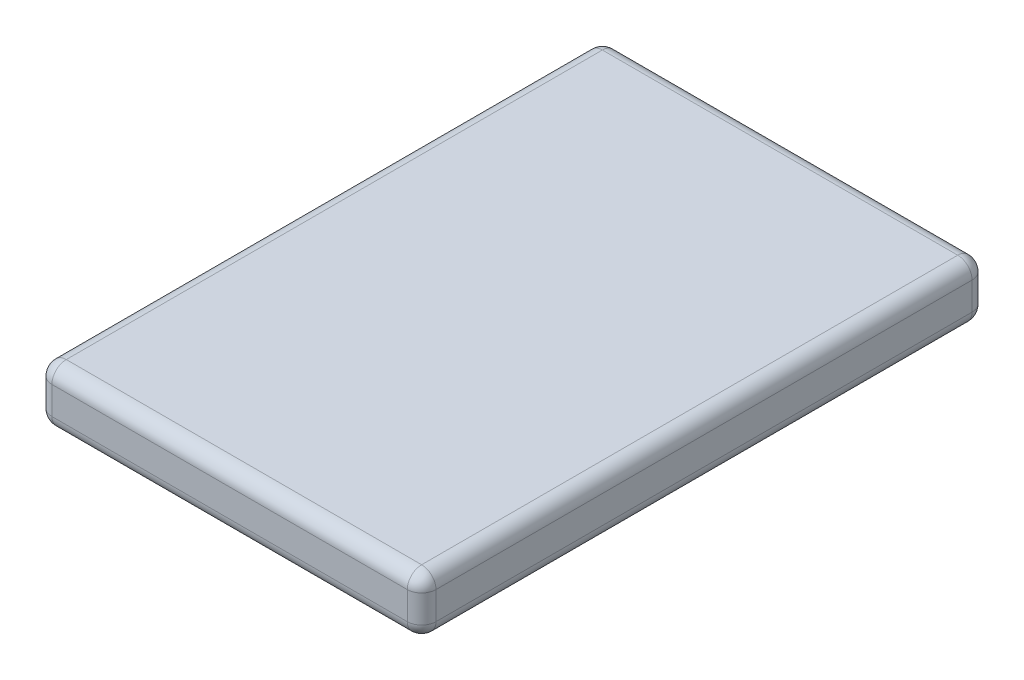
ISO-10303-21;
HEADER;
FILE_DESCRIPTION(('STEP AP214'),'2;1');
FILE_NAME('part.step','',(''),(''),'','','');
FILE_SCHEMA(('AUTOMOTIVE_DESIGN { 1 0 10303 214 1 1 1 1 }'));
ENDSEC;
DATA;
#1=APPLICATION_CONTEXT('core data for automotive mechanical design processes');
#2=APPLICATION_PROTOCOL_DEFINITION('international standard','automotive_design',2000,#1);
#3=PRODUCT_CONTEXT('',#1,'mechanical');
#4=PRODUCT('Part','Part','',(#3));
#5=PRODUCT_RELATED_PRODUCT_CATEGORY('part','',(#4));
#6=PRODUCT_DEFINITION_FORMATION('','',#4);
#7=PRODUCT_DEFINITION_CONTEXT('part definition',#1,'design');
#8=PRODUCT_DEFINITION('design','',#6,#7);
#9=PRODUCT_DEFINITION_SHAPE('','',#8);
#10=(LENGTH_UNIT() NAMED_UNIT(*) SI_UNIT(.MILLI.,.METRE.));
#11=(NAMED_UNIT(*) PLANE_ANGLE_UNIT() SI_UNIT($,.RADIAN.));
#12=(NAMED_UNIT(*) SI_UNIT($,.STERADIAN.) SOLID_ANGLE_UNIT());
#13=UNCERTAINTY_MEASURE_WITH_UNIT(LENGTH_MEASURE(1.E-05),#10,'distance_accuracy_value','');
#14=(GEOMETRIC_REPRESENTATION_CONTEXT(3) GLOBAL_UNCERTAINTY_ASSIGNED_CONTEXT((#13)) GLOBAL_UNIT_ASSIGNED_CONTEXT((#10,
#11,#12)) REPRESENTATION_CONTEXT('',''));
#15=CARTESIAN_POINT('',(0.,0.,0.));
#16=DIRECTION('',(0.,0.,1.));
#17=DIRECTION('',(1.,0.,0.));
#18=AXIS2_PLACEMENT_3D('',#15,#16,#17);
#19=CARTESIAN_POINT('',(-15.73,-1.23,50.000000076));
#20=DIRECTION('',(0.,0.,-1.));
#21=DIRECTION('',(-1.,0.,0.));
#22=AXIS2_PLACEMENT_3D('',#19,#20,#21);
#23=CYLINDRICAL_SURFACE('',#22,1.27);
#24=DIRECTION('',(0.,0.,-1.));
#25=VECTOR('',#24,1.);
#26=CARTESIAN_POINT('',(-15.73,-2.5,50.000000076));
#27=LINE('',#26,#25);
#28=CARTESIAN_POINT('',(-15.73,-2.5,48.730000076));
#29=VERTEX_POINT('',#28);
#30=CARTESIAN_POINT('',(-15.73,-2.5,1.27));
#31=VERTEX_POINT('',#30);
#32=EDGE_CURVE('E170',#29,#31,#27,.T.);
#33=ORIENTED_EDGE('',*,*,#32,.F.);
#34=CARTESIAN_POINT('',(-15.73,-1.23,48.730000076));
#35=DIRECTION('',(0.,0.,-1.));
#36=DIRECTION('',(-1.,0.,0.));
#37=AXIS2_PLACEMENT_3D('',#34,#35,#36);
#38=CIRCLE('',#37,1.27);
#39=CARTESIAN_POINT('',(-17.,-1.23,48.730000076));
#40=VERTEX_POINT('',#39);
#41=EDGE_CURVE('E190',#29,#40,#38,.T.);
#42=ORIENTED_EDGE('',*,*,#41,.T.);
#43=DIRECTION('',(0.,0.,-1.));
#44=VECTOR('',#43,1.);
#45=CARTESIAN_POINT('',(-17.,-1.23,50.000000076));
#46=LINE('',#45,#44);
#47=CARTESIAN_POINT('',(-17.,-1.23,1.27));
#48=VERTEX_POINT('',#47);
#49=EDGE_CURVE('E256',#40,#48,#46,.T.);
#50=ORIENTED_EDGE('',*,*,#49,.T.);
#51=CARTESIAN_POINT('',(-15.73,-1.23,1.27));
#52=DIRECTION('',(0.,0.,-1.));
#53=DIRECTION('',(-1.,0.,0.));
#54=AXIS2_PLACEMENT_3D('',#51,#52,#53);
#55=CIRCLE('',#54,1.27);
#56=EDGE_CURVE('E187',#48,#31,#55,.F.);
#57=ORIENTED_EDGE('',*,*,#56,.T.);
#58=EDGE_LOOP('',(#33,#42,#50,#57));
#59=FACE_BOUND('',#58,.T.);
#60=ADVANCED_FACE('F45',(#59),#23,.T.);
#61=CARTESIAN_POINT('',(-15.73,-2.5,50.000000076));
#62=DIRECTION('',(0.,1.,0.));
#63=DIRECTION('',(0.,0.,1.));
#64=AXIS2_PLACEMENT_3D('',#61,#62,#63);
#65=PLANE('',#64);
#66=DIRECTION('',(0.,0.,-1.));
#67=VECTOR('',#66,1.);
#68=CARTESIAN_POINT('',(15.73,-2.5,50.000000076));
#69=LINE('',#68,#67);
#70=CARTESIAN_POINT('',(15.73,-2.5,48.730000076));
#71=VERTEX_POINT('',#70);
#72=CARTESIAN_POINT('',(15.73,-2.5,1.27));
#73=VERTEX_POINT('',#72);
#74=EDGE_CURVE('E315',#71,#73,#69,.T.);
#75=ORIENTED_EDGE('',*,*,#74,.F.);
#76=DIRECTION('',(1.,0.,0.));
#77=VECTOR('',#76,1.);
#78=CARTESIAN_POINT('',(-15.73,-2.5,48.730000076));
#79=LINE('',#78,#77);
#80=EDGE_CURVE('E145',#71,#29,#79,.F.);
#81=ORIENTED_EDGE('',*,*,#80,.T.);
#82=ORIENTED_EDGE('',*,*,#32,.T.);
#83=DIRECTION('',(1.,0.,0.));
#84=VECTOR('',#83,1.);
#85=CARTESIAN_POINT('',(15.73,-2.5,1.27));
#86=LINE('',#85,#84);
#87=EDGE_CURVE('E177',#31,#73,#86,.T.);
#88=ORIENTED_EDGE('',*,*,#87,.T.);
#89=EDGE_LOOP('',(#75,#81,#82,#88));
#90=FACE_BOUND('',#89,.T.);
#91=ADVANCED_FACE('F351',(#90),#65,.F.);
#92=CARTESIAN_POINT('',(15.73,-1.23,50.000000076));
#93=DIRECTION('',(0.,0.,-1.));
#94=DIRECTION('',(-1.,0.,0.));
#95=AXIS2_PLACEMENT_3D('',#92,#93,#94);
#96=CYLINDRICAL_SURFACE('',#95,1.27);
#97=ORIENTED_EDGE('',*,*,#74,.T.);
#98=CARTESIAN_POINT('',(15.73,-1.23,1.27));
#99=DIRECTION('',(0.,0.,-1.));
#100=DIRECTION('',(-1.,0.,0.));
#101=AXIS2_PLACEMENT_3D('',#98,#99,#100);
#102=CIRCLE('',#101,1.27);
#103=CARTESIAN_POINT('',(17.,-1.23,1.27));
#104=VERTEX_POINT('',#103);
#105=EDGE_CURVE('E225',#73,#104,#102,.F.);
#106=ORIENTED_EDGE('',*,*,#105,.T.);
#107=DIRECTION('',(0.,0.,-1.));
#108=VECTOR('',#107,1.);
#109=CARTESIAN_POINT('',(17.,-1.23,50.000000076));
#110=LINE('',#109,#108);
#111=CARTESIAN_POINT('',(17.,-1.23,48.730000076));
#112=VERTEX_POINT('',#111);
#113=EDGE_CURVE('E313',#112,#104,#110,.T.);
#114=ORIENTED_EDGE('',*,*,#113,.F.);
#115=CARTESIAN_POINT('',(15.73,-1.23,48.730000076));
#116=DIRECTION('',(0.,0.,-1.));
#117=DIRECTION('',(-1.,0.,0.));
#118=AXIS2_PLACEMENT_3D('',#115,#116,#117);
#119=CIRCLE('',#118,1.27);
#120=EDGE_CURVE('E155',#112,#71,#119,.T.);
#121=ORIENTED_EDGE('',*,*,#120,.T.);
#122=EDGE_LOOP('',(#97,#106,#114,#121));
#123=FACE_BOUND('',#122,.T.);
#124=ADVANCED_FACE('F312',(#123),#96,.T.);
#125=CARTESIAN_POINT('',(17.,-1.23,50.000000076));
#126=DIRECTION('',(-1.,0.,0.));
#127=DIRECTION('',(0.,0.,1.));
#128=AXIS2_PLACEMENT_3D('',#125,#126,#127);
#129=PLANE('',#128);
#130=DIRECTION('',(0.,0.,-1.));
#131=VECTOR('',#130,1.);
#132=CARTESIAN_POINT('',(17.,1.23,50.000000076));
#133=LINE('',#132,#131);
#134=CARTESIAN_POINT('',(17.,1.23,48.730000076));
#135=VERTEX_POINT('',#134);
#136=CARTESIAN_POINT('',(17.,1.23,1.27));
#137=VERTEX_POINT('',#136);
#138=EDGE_CURVE('E318',#135,#137,#133,.T.);
#139=ORIENTED_EDGE('',*,*,#138,.F.);
#140=DIRECTION('',(0.,1.,0.));
#141=VECTOR('',#140,1.);
#142=CARTESIAN_POINT('',(17.,-1.23,48.730000076));
#143=LINE('',#142,#141);
#144=EDGE_CURVE('E220',#135,#112,#143,.F.);
#145=ORIENTED_EDGE('',*,*,#144,.T.);
#146=ORIENTED_EDGE('',*,*,#113,.T.);
#147=DIRECTION('',(0.,1.,0.));
#148=VECTOR('',#147,1.);
#149=CARTESIAN_POINT('',(17.,1.23,1.27));
#150=LINE('',#149,#148);
#151=EDGE_CURVE('E217',#104,#137,#150,.T.);
#152=ORIENTED_EDGE('',*,*,#151,.T.);
#153=EDGE_LOOP('',(#139,#145,#146,#152));
#154=FACE_BOUND('',#153,.T.);
#155=ADVANCED_FACE('F316',(#154),#129,.F.);
#156=CARTESIAN_POINT('',(15.73,1.23,50.000000076));
#157=DIRECTION('',(0.,0.,-1.));
#158=DIRECTION('',(-1.,0.,0.));
#159=AXIS2_PLACEMENT_3D('',#156,#157,#158);
#160=CYLINDRICAL_SURFACE('',#159,1.27);
#161=DIRECTION('',(0.,0.,-1.));
#162=VECTOR('',#161,1.);
#163=CARTESIAN_POINT('',(15.73,2.5,50.000000076));
#164=LINE('',#163,#162);
#165=CARTESIAN_POINT('',(15.73,2.5,48.730000076));
#166=VERTEX_POINT('',#165);
#167=CARTESIAN_POINT('',(15.73,2.5,1.27));
#168=VERTEX_POINT('',#167);
#169=EDGE_CURVE('E323',#166,#168,#164,.T.);
#170=ORIENTED_EDGE('',*,*,#169,.F.);
#171=CARTESIAN_POINT('',(15.73,1.23,48.730000076));
#172=DIRECTION('',(0.,0.,-1.));
#173=DIRECTION('',(-1.,0.,0.));
#174=AXIS2_PLACEMENT_3D('',#171,#172,#173);
#175=CIRCLE('',#174,1.27);
#176=EDGE_CURVE('E214',#166,#135,#175,.T.);
#177=ORIENTED_EDGE('',*,*,#176,.T.);
#178=ORIENTED_EDGE('',*,*,#138,.T.);
#179=CARTESIAN_POINT('',(15.73,1.23,1.27));
#180=DIRECTION('',(0.,0.,-1.));
#181=DIRECTION('',(-1.,0.,0.));
#182=AXIS2_PLACEMENT_3D('',#179,#180,#181);
#183=CIRCLE('',#182,1.27);
#184=EDGE_CURVE('E211',#137,#168,#183,.F.);
#185=ORIENTED_EDGE('',*,*,#184,.T.);
#186=EDGE_LOOP('',(#170,#177,#178,#185));
#187=FACE_BOUND('',#186,.T.);
#188=ADVANCED_FACE('F519',(#187),#160,.T.);
#189=CARTESIAN_POINT('',(-15.73,2.5,50.000000076));
#190=DIRECTION('',(0.,-1.,0.));
#191=DIRECTION('',(0.,0.,-1.));
#192=AXIS2_PLACEMENT_3D('',#189,#190,#191);
#193=PLANE('',#192);
#194=DIRECTION('',(0.,0.,-1.));
#195=VECTOR('',#194,1.);
#196=CARTESIAN_POINT('',(-15.73,2.5,50.000000076));
#197=LINE('',#196,#195);
#198=CARTESIAN_POINT('',(-15.73,2.5,48.730000076));
#199=VERTEX_POINT('',#198);
#200=CARTESIAN_POINT('',(-15.73,2.5,1.27));
#201=VERTEX_POINT('',#200);
#202=EDGE_CURVE('E578',#199,#201,#197,.T.);
#203=ORIENTED_EDGE('',*,*,#202,.F.);
#204=DIRECTION('',(-1.,0.,0.));
#205=VECTOR('',#204,1.);
#206=CARTESIAN_POINT('',(-15.73,2.5,48.730000076));
#207=LINE('',#206,#205);
#208=EDGE_CURVE('E208',#199,#166,#207,.F.);
#209=ORIENTED_EDGE('',*,*,#208,.T.);
#210=ORIENTED_EDGE('',*,*,#169,.T.);
#211=DIRECTION('',(-1.,0.,0.));
#212=VECTOR('',#211,1.);
#213=CARTESIAN_POINT('',(-15.73,2.5,1.27));
#214=LINE('',#213,#212);
#215=EDGE_CURVE('E205',#168,#201,#214,.T.);
#216=ORIENTED_EDGE('',*,*,#215,.T.);
#217=EDGE_LOOP('',(#203,#209,#210,#216));
#218=FACE_BOUND('',#217,.T.);
#219=ADVANCED_FACE('F510',(#218),#193,.F.);
#220=CARTESIAN_POINT('',(-15.73,1.23,50.000000076));
#221=DIRECTION('',(0.,0.,-1.));
#222=DIRECTION('',(-1.,0.,0.));
#223=AXIS2_PLACEMENT_3D('',#220,#221,#222);
#224=CYLINDRICAL_SURFACE('',#223,1.27);
#225=DIRECTION('',(0.,0.,-1.));
#226=VECTOR('',#225,1.);
#227=CARTESIAN_POINT('',(-17.,1.23,50.000000076));
#228=LINE('',#227,#226);
#229=CARTESIAN_POINT('',(-17.,1.23,48.730000076));
#230=VERTEX_POINT('',#229);
#231=CARTESIAN_POINT('',(-17.,1.23,1.27));
#232=VERTEX_POINT('',#231);
#233=EDGE_CURVE('E581',#230,#232,#228,.T.);
#234=ORIENTED_EDGE('',*,*,#233,.F.);
#235=CARTESIAN_POINT('',(-15.73,1.23,48.730000076));
#236=DIRECTION('',(0.,0.,-1.));
#237=DIRECTION('',(-1.,0.,0.));
#238=AXIS2_PLACEMENT_3D('',#235,#236,#237);
#239=CIRCLE('',#238,1.27);
#240=EDGE_CURVE('E202',#230,#199,#239,.T.);
#241=ORIENTED_EDGE('',*,*,#240,.T.);
#242=ORIENTED_EDGE('',*,*,#202,.T.);
#243=CARTESIAN_POINT('',(-15.73,1.23,1.27));
#244=DIRECTION('',(0.,0.,-1.));
#245=DIRECTION('',(-1.,0.,0.));
#246=AXIS2_PLACEMENT_3D('',#243,#244,#245);
#247=CIRCLE('',#246,1.27);
#248=EDGE_CURVE('E199',#201,#232,#247,.F.);
#249=ORIENTED_EDGE('',*,*,#248,.T.);
#250=EDGE_LOOP('',(#234,#241,#242,#249));
#251=FACE_BOUND('',#250,.T.);
#252=ADVANCED_FACE('F501',(#251),#224,.T.);
#253=CARTESIAN_POINT('',(-17.,-1.23,50.000000076));
#254=DIRECTION('',(1.,0.,0.));
#255=DIRECTION('',(0.,0.,-1.));
#256=AXIS2_PLACEMENT_3D('',#253,#254,#255);
#257=PLANE('',#256);
#258=ORIENTED_EDGE('',*,*,#49,.F.);
#259=DIRECTION('',(0.,-1.,0.));
#260=VECTOR('',#259,1.);
#261=CARTESIAN_POINT('',(-17.,-1.23,48.730000076));
#262=LINE('',#261,#260);
#263=EDGE_CURVE('E196',#40,#230,#262,.F.);
#264=ORIENTED_EDGE('',*,*,#263,.T.);
#265=ORIENTED_EDGE('',*,*,#233,.T.);
#266=DIRECTION('',(0.,-1.,0.));
#267=VECTOR('',#266,1.);
#268=CARTESIAN_POINT('',(-17.,-1.23,1.27));
#269=LINE('',#268,#267);
#270=EDGE_CURVE('E193',#232,#48,#269,.T.);
#271=ORIENTED_EDGE('',*,*,#270,.T.);
#272=EDGE_LOOP('',(#258,#264,#265,#271));
#273=FACE_BOUND('',#272,.T.);
#274=ADVANCED_FACE('F493',(#273),#257,.F.);
#275=CARTESIAN_POINT('',(-15.73,-1.23,50.000000076));
#276=DIRECTION('',(0.,0.,-1.));
#277=DIRECTION('',(-1.,0.,0.));
#278=AXIS2_PLACEMENT_3D('',#275,#276,#277);
#279=PLANE('',#278);
#280=DIRECTION('',(0.,-1.,0.));
#281=VECTOR('',#280,1.);
#282=CARTESIAN_POINT('',(-15.73,-1.23,50.000000076));
#283=LINE('',#282,#281);
#284=CARTESIAN_POINT('',(-15.73,1.23,50.000000076));
#285=VERTEX_POINT('',#284);
#286=CARTESIAN_POINT('',(-15.73,-1.23,50.000000076));
#287=VERTEX_POINT('',#286);
#288=EDGE_CURVE('E174',#285,#287,#283,.T.);
#289=ORIENTED_EDGE('',*,*,#288,.T.);
#290=DIRECTION('',(1.,0.,0.));
#291=VECTOR('',#290,1.);
#292=CARTESIAN_POINT('',(-15.73,-1.23,50.000000076));
#293=LINE('',#292,#291);
#294=CARTESIAN_POINT('',(15.73,-1.23,50.000000076));
#295=VERTEX_POINT('',#294);
#296=EDGE_CURVE('E143',#287,#295,#293,.T.);
#297=ORIENTED_EDGE('',*,*,#296,.T.);
#298=DIRECTION('',(0.,1.,0.));
#299=VECTOR('',#298,1.);
#300=CARTESIAN_POINT('',(15.73,-1.23,50.000000076));
#301=LINE('',#300,#299);
#302=CARTESIAN_POINT('',(15.73,1.23,50.000000076));
#303=VERTEX_POINT('',#302);
#304=EDGE_CURVE('E162',#295,#303,#301,.T.);
#305=ORIENTED_EDGE('',*,*,#304,.T.);
#306=DIRECTION('',(-1.,0.,0.));
#307=VECTOR('',#306,1.);
#308=CARTESIAN_POINT('',(-15.73,1.23,50.000000076));
#309=LINE('',#308,#307);
#310=EDGE_CURVE('E169',#303,#285,#309,.T.);
#311=ORIENTED_EDGE('',*,*,#310,.T.);
#312=EDGE_LOOP('',(#289,#297,#305,#311));
#313=FACE_BOUND('',#312,.T.);
#314=ADVANCED_FACE('F172',(#313),#279,.F.);
#315=CARTESIAN_POINT('',(-15.73,-1.23,0.));
#316=DIRECTION('',(0.,0.,-1.));
#317=DIRECTION('',(-1.,0.,0.));
#318=AXIS2_PLACEMENT_3D('',#315,#316,#317);
#319=PLANE('',#318);
#320=DIRECTION('',(0.,1.,0.));
#321=VECTOR('',#320,1.);
#322=CARTESIAN_POINT('',(15.73,-1.23,0.));
#323=LINE('',#322,#321);
#324=CARTESIAN_POINT('',(15.73,1.23,0.));
#325=VERTEX_POINT('',#324);
#326=CARTESIAN_POINT('',(15.73,-1.23,0.));
#327=VERTEX_POINT('',#326);
#328=EDGE_CURVE('E229',#325,#327,#323,.F.);
#329=ORIENTED_EDGE('',*,*,#328,.T.);
#330=DIRECTION('',(1.,0.,0.));
#331=VECTOR('',#330,1.);
#332=CARTESIAN_POINT('',(-15.73,-1.23,0.));
#333=LINE('',#332,#331);
#334=CARTESIAN_POINT('',(-15.73,-1.23,0.));
#335=VERTEX_POINT('',#334);
#336=EDGE_CURVE('E11',#327,#335,#333,.F.);
#337=ORIENTED_EDGE('',*,*,#336,.T.);
#338=DIRECTION('',(0.,-1.,0.));
#339=VECTOR('',#338,1.);
#340=CARTESIAN_POINT('',(-15.73,1.23,0.));
#341=LINE('',#340,#339);
#342=CARTESIAN_POINT('',(-15.73,1.23,0.));
#343=VERTEX_POINT('',#342);
#344=EDGE_CURVE('E55',#335,#343,#341,.F.);
#345=ORIENTED_EDGE('',*,*,#344,.T.);
#346=DIRECTION('',(-1.,0.,0.));
#347=VECTOR('',#346,1.);
#348=CARTESIAN_POINT('',(15.73,1.23,0.));
#349=LINE('',#348,#347);
#350=EDGE_CURVE('E232',#343,#325,#349,.F.);
#351=ORIENTED_EDGE('',*,*,#350,.T.);
#352=EDGE_LOOP('',(#329,#337,#345,#351));
#353=FACE_BOUND('',#352,.T.);
#354=ADVANCED_FACE('F294',(#353),#319,.T.);
#355=CARTESIAN_POINT('',(-15.73,1.23,48.730000076));
#356=DIRECTION('',(-1.,0.,0.));
#357=DIRECTION('',(0.,0.,1.));
#358=AXIS2_PLACEMENT_3D('',#355,#356,#357);
#359=CYLINDRICAL_SURFACE('',#358,1.27);
#360=CARTESIAN_POINT('',(15.73,1.23,48.730000076));
#361=DIRECTION('',(1.,0.,0.));
#362=DIRECTION('',(0.,0.,-1.));
#363=AXIS2_PLACEMENT_3D('',#360,#361,#362);
#364=CIRCLE('',#363,1.27);
#365=EDGE_CURVE('E248',#166,#303,#364,.T.);
#366=ORIENTED_EDGE('',*,*,#365,.F.);
#367=ORIENTED_EDGE('',*,*,#208,.F.);
#368=CARTESIAN_POINT('',(-15.73,1.23,48.730000076));
#369=DIRECTION('',(-1.,0.,0.));
#370=DIRECTION('',(0.,0.,1.));
#371=AXIS2_PLACEMENT_3D('',#368,#369,#370);
#372=CIRCLE('',#371,1.27);
#373=EDGE_CURVE('E252',#285,#199,#372,.T.);
#374=ORIENTED_EDGE('',*,*,#373,.F.);
#375=ORIENTED_EDGE('',*,*,#310,.F.);
#376=EDGE_LOOP('',(#366,#367,#374,#375));
#377=FACE_BOUND('',#376,.T.);
#378=ADVANCED_FACE('F335',(#377),#359,.T.);
#379=CARTESIAN_POINT('',(-15.73,1.23,48.730000076));
#380=DIRECTION('',(0.,0.,-1.));
#381=DIRECTION('',(-1.,0.,0.));
#382=AXIS2_PLACEMENT_3D('',#379,#380,#381);
#383=SPHERICAL_SURFACE('',#382,1.27);
#384=ORIENTED_EDGE('',*,*,#373,.T.);
#385=ORIENTED_EDGE('',*,*,#240,.F.);
#386=CARTESIAN_POINT('',(-15.73,1.23,48.730000076));
#387=DIRECTION('',(0.,-1.,0.));
#388=DIRECTION('',(1.,0.,0.));
#389=AXIS2_PLACEMENT_3D('',#386,#387,#388);
#390=CIRCLE('',#389,1.27);
#391=EDGE_CURVE('E244',#285,#230,#390,.T.);
#392=ORIENTED_EDGE('',*,*,#391,.F.);
#393=EDGE_LOOP('',(#384,#385,#392));
#394=FACE_BOUND('',#393,.T.);
#395=ADVANCED_FACE('F338',(#394),#383,.T.);
#396=CARTESIAN_POINT('',(15.73,1.23,48.730000076));
#397=DIRECTION('',(0.,0.,-1.));
#398=DIRECTION('',(-1.,0.,0.));
#399=AXIS2_PLACEMENT_3D('',#396,#397,#398);
#400=SPHERICAL_SURFACE('',#399,1.27);
#401=ORIENTED_EDGE('',*,*,#176,.F.);
#402=ORIENTED_EDGE('',*,*,#365,.T.);
#403=CARTESIAN_POINT('',(15.73,1.23,48.730000076));
#404=DIRECTION('',(0.,-1.,0.));
#405=DIRECTION('',(1.,0.,0.));
#406=AXIS2_PLACEMENT_3D('',#403,#404,#405);
#407=CIRCLE('',#406,1.27);
#408=EDGE_CURVE('E165',#135,#303,#407,.T.);
#409=ORIENTED_EDGE('',*,*,#408,.F.);
#410=EDGE_LOOP('',(#401,#402,#409));
#411=FACE_BOUND('',#410,.T.);
#412=ADVANCED_FACE('F383',(#411),#400,.T.);
#413=CARTESIAN_POINT('',(-15.73,-1.23,48.730000076));
#414=DIRECTION('',(0.,-1.,0.));
#415=DIRECTION('',(0.,0.,-1.));
#416=AXIS2_PLACEMENT_3D('',#413,#414,#415);
#417=CYLINDRICAL_SURFACE('',#416,1.27);
#418=ORIENTED_EDGE('',*,*,#391,.T.);
#419=ORIENTED_EDGE('',*,*,#263,.F.);
#420=CARTESIAN_POINT('',(-15.73,-1.23,48.730000076));
#421=DIRECTION('',(0.,-1.,0.));
#422=DIRECTION('',(1.,0.,0.));
#423=AXIS2_PLACEMENT_3D('',#420,#421,#422);
#424=CIRCLE('',#423,1.27);
#425=EDGE_CURVE('E159',#287,#40,#424,.T.);
#426=ORIENTED_EDGE('',*,*,#425,.F.);
#427=ORIENTED_EDGE('',*,*,#288,.F.);
#428=EDGE_LOOP('',(#418,#419,#426,#427));
#429=FACE_BOUND('',#428,.T.);
#430=ADVANCED_FACE('F341',(#429),#417,.T.);
#431=CARTESIAN_POINT('',(15.73,-1.23,48.730000076));
#432=DIRECTION('',(0.,1.,0.));
#433=DIRECTION('',(0.,0.,1.));
#434=AXIS2_PLACEMENT_3D('',#431,#432,#433);
#435=CYLINDRICAL_SURFACE('',#434,1.27);
#436=ORIENTED_EDGE('',*,*,#408,.T.);
#437=ORIENTED_EDGE('',*,*,#304,.F.);
#438=CARTESIAN_POINT('',(15.73,-1.23,48.730000076));
#439=DIRECTION('',(0.,-1.,0.));
#440=DIRECTION('',(0.,0.,-1.));
#441=AXIS2_PLACEMENT_3D('',#438,#439,#440);
#442=CIRCLE('',#441,1.27);
#443=EDGE_CURVE('E152',#112,#295,#442,.T.);
#444=ORIENTED_EDGE('',*,*,#443,.F.);
#445=ORIENTED_EDGE('',*,*,#144,.F.);
#446=EDGE_LOOP('',(#436,#437,#444,#445));
#447=FACE_BOUND('',#446,.T.);
#448=ADVANCED_FACE('F163',(#447),#435,.T.);
#449=CARTESIAN_POINT('',(-15.73,-1.23,48.730000076));
#450=DIRECTION('',(0.,0.,-1.));
#451=DIRECTION('',(-1.,0.,0.));
#452=AXIS2_PLACEMENT_3D('',#449,#450,#451);
#453=SPHERICAL_SURFACE('',#452,1.27);
#454=ORIENTED_EDGE('',*,*,#425,.T.);
#455=ORIENTED_EDGE('',*,*,#41,.F.);
#456=CARTESIAN_POINT('',(-15.73,-1.23,48.730000076));
#457=DIRECTION('',(1.,0.,0.));
#458=DIRECTION('',(0.,0.,-1.));
#459=AXIS2_PLACEMENT_3D('',#456,#457,#458);
#460=CIRCLE('',#459,1.27);
#461=EDGE_CURVE('E149',#287,#29,#460,.T.);
#462=ORIENTED_EDGE('',*,*,#461,.F.);
#463=EDGE_LOOP('',(#454,#455,#462));
#464=FACE_BOUND('',#463,.T.);
#465=ADVANCED_FACE('F345',(#464),#453,.T.);
#466=CARTESIAN_POINT('',(15.73,-1.23,48.730000076));
#467=DIRECTION('',(0.,0.,-1.));
#468=DIRECTION('',(-1.,0.,0.));
#469=AXIS2_PLACEMENT_3D('',#466,#467,#468);
#470=SPHERICAL_SURFACE('',#469,1.27);
#471=ORIENTED_EDGE('',*,*,#120,.F.);
#472=ORIENTED_EDGE('',*,*,#443,.T.);
#473=CARTESIAN_POINT('',(15.73,-1.23,48.730000076));
#474=DIRECTION('',(-1.,0.,0.));
#475=DIRECTION('',(0.,0.,1.));
#476=AXIS2_PLACEMENT_3D('',#473,#474,#475);
#477=CIRCLE('',#476,1.27);
#478=EDGE_CURVE('E139',#71,#295,#477,.T.);
#479=ORIENTED_EDGE('',*,*,#478,.F.);
#480=EDGE_LOOP('',(#471,#472,#479));
#481=FACE_BOUND('',#480,.T.);
#482=ADVANCED_FACE('F154',(#481),#470,.T.);
#483=CARTESIAN_POINT('',(-15.73,-1.23,48.730000076));
#484=DIRECTION('',(1.,0.,0.));
#485=DIRECTION('',(0.,0.,-1.));
#486=AXIS2_PLACEMENT_3D('',#483,#484,#485);
#487=CYLINDRICAL_SURFACE('',#486,1.27);
#488=ORIENTED_EDGE('',*,*,#461,.T.);
#489=ORIENTED_EDGE('',*,*,#80,.F.);
#490=ORIENTED_EDGE('',*,*,#478,.T.);
#491=ORIENTED_EDGE('',*,*,#296,.F.);
#492=EDGE_LOOP('',(#488,#489,#490,#491));
#493=FACE_BOUND('',#492,.T.);
#494=ADVANCED_FACE('F141',(#493),#487,.T.);
#495=CARTESIAN_POINT('',(-15.73,1.23,1.27));
#496=DIRECTION('',(0.,0.,-1.));
#497=DIRECTION('',(-1.,0.,0.));
#498=AXIS2_PLACEMENT_3D('',#495,#496,#497);
#499=SPHERICAL_SURFACE('',#498,1.27);
#500=CARTESIAN_POINT('',(-15.73,1.23,1.27));
#501=DIRECTION('',(1.,0.,0.));
#502=DIRECTION('',(0.,0.,-1.));
#503=AXIS2_PLACEMENT_3D('',#500,#501,#502);
#504=CIRCLE('',#503,1.27);
#505=EDGE_CURVE('E276',#343,#201,#504,.T.);
#506=ORIENTED_EDGE('',*,*,#505,.F.);
#507=CARTESIAN_POINT('',(-15.73,1.23,1.27));
#508=DIRECTION('',(0.,-1.,0.));
#509=DIRECTION('',(1.,0.,0.));
#510=AXIS2_PLACEMENT_3D('',#507,#508,#509);
#511=CIRCLE('',#510,1.27);
#512=EDGE_CURVE('E49',#232,#343,#511,.T.);
#513=ORIENTED_EDGE('',*,*,#512,.F.);
#514=ORIENTED_EDGE('',*,*,#248,.F.);
#515=EDGE_LOOP('',(#506,#513,#514));
#516=FACE_BOUND('',#515,.T.);
#517=ADVANCED_FACE('F47',(#516),#499,.T.);
#518=CARTESIAN_POINT('',(-15.73,-1.23,1.27));
#519=DIRECTION('',(0.,1.,0.));
#520=DIRECTION('',(0.,0.,1.));
#521=AXIS2_PLACEMENT_3D('',#518,#519,#520);
#522=CYLINDRICAL_SURFACE('',#521,1.27);
#523=ORIENTED_EDGE('',*,*,#512,.T.);
#524=ORIENTED_EDGE('',*,*,#344,.F.);
#525=CARTESIAN_POINT('',(-15.73,-1.23,1.27));
#526=DIRECTION('',(0.,-1.,0.));
#527=DIRECTION('',(0.,0.,-1.));
#528=AXIS2_PLACEMENT_3D('',#525,#526,#527);
#529=CIRCLE('',#528,1.27);
#530=EDGE_CURVE('E274',#48,#335,#529,.T.);
#531=ORIENTED_EDGE('',*,*,#530,.F.);
#532=ORIENTED_EDGE('',*,*,#270,.F.);
#533=EDGE_LOOP('',(#523,#524,#531,#532));
#534=FACE_BOUND('',#533,.T.);
#535=ADVANCED_FACE('F287',(#534),#522,.T.);
#536=CARTESIAN_POINT('',(-15.73,1.23,1.27));
#537=DIRECTION('',(1.,0.,0.));
#538=DIRECTION('',(0.,0.,-1.));
#539=AXIS2_PLACEMENT_3D('',#536,#537,#538);
#540=CYLINDRICAL_SURFACE('',#539,1.27);
#541=ORIENTED_EDGE('',*,*,#505,.T.);
#542=ORIENTED_EDGE('',*,*,#215,.F.);
#543=CARTESIAN_POINT('',(15.73,1.23,1.27));
#544=DIRECTION('',(1.,0.,0.));
#545=DIRECTION('',(0.,0.,-1.));
#546=AXIS2_PLACEMENT_3D('',#543,#544,#545);
#547=CIRCLE('',#546,1.27);
#548=EDGE_CURVE('E270',#325,#168,#547,.T.);
#549=ORIENTED_EDGE('',*,*,#548,.F.);
#550=ORIENTED_EDGE('',*,*,#350,.F.);
#551=EDGE_LOOP('',(#541,#542,#549,#550));
#552=FACE_BOUND('',#551,.T.);
#553=ADVANCED_FACE('F292',(#552),#540,.T.);
#554=CARTESIAN_POINT('',(-15.73,-1.23,1.27));
#555=DIRECTION('',(0.,0.,-1.));
#556=DIRECTION('',(-1.,0.,0.));
#557=AXIS2_PLACEMENT_3D('',#554,#555,#556);
#558=SPHERICAL_SURFACE('',#557,1.27);
#559=ORIENTED_EDGE('',*,*,#56,.F.);
#560=ORIENTED_EDGE('',*,*,#530,.T.);
#561=CARTESIAN_POINT('',(-15.73,-1.23,1.27));
#562=DIRECTION('',(1.,0.,0.));
#563=DIRECTION('',(0.,0.,-1.));
#564=AXIS2_PLACEMENT_3D('',#561,#562,#563);
#565=CIRCLE('',#564,1.27);
#566=EDGE_CURVE('E63',#31,#335,#565,.T.);
#567=ORIENTED_EDGE('',*,*,#566,.F.);
#568=EDGE_LOOP('',(#559,#560,#567));
#569=FACE_BOUND('',#568,.T.);
#570=ADVANCED_FACE('F354',(#569),#558,.T.);
#571=CARTESIAN_POINT('',(15.73,1.23,1.27));
#572=DIRECTION('',(0.,0.,-1.));
#573=DIRECTION('',(-1.,0.,0.));
#574=AXIS2_PLACEMENT_3D('',#571,#572,#573);
#575=SPHERICAL_SURFACE('',#574,1.27);
#576=ORIENTED_EDGE('',*,*,#548,.T.);
#577=ORIENTED_EDGE('',*,*,#184,.F.);
#578=CARTESIAN_POINT('',(15.73,1.23,1.27));
#579=DIRECTION('',(0.,-1.,0.));
#580=DIRECTION('',(1.,0.,0.));
#581=AXIS2_PLACEMENT_3D('',#578,#579,#580);
#582=CIRCLE('',#581,1.27);
#583=EDGE_CURVE('E264',#325,#137,#582,.T.);
#584=ORIENTED_EDGE('',*,*,#583,.F.);
#585=EDGE_LOOP('',(#576,#577,#584));
#586=FACE_BOUND('',#585,.T.);
#587=ADVANCED_FACE('F356',(#586),#575,.T.);
#588=CARTESIAN_POINT('',(-15.73,-1.23,1.27));
#589=DIRECTION('',(-1.,0.,0.));
#590=DIRECTION('',(0.,0.,1.));
#591=AXIS2_PLACEMENT_3D('',#588,#589,#590);
#592=CYLINDRICAL_SURFACE('',#591,1.27);
#593=ORIENTED_EDGE('',*,*,#566,.T.);
#594=ORIENTED_EDGE('',*,*,#336,.F.);
#595=CARTESIAN_POINT('',(15.73,-1.23,1.27));
#596=DIRECTION('',(1.,0.,0.));
#597=DIRECTION('',(0.,0.,-1.));
#598=AXIS2_PLACEMENT_3D('',#595,#596,#597);
#599=CIRCLE('',#598,1.27);
#600=EDGE_CURVE('E260',#73,#327,#599,.T.);
#601=ORIENTED_EDGE('',*,*,#600,.F.);
#602=ORIENTED_EDGE('',*,*,#87,.F.);
#603=EDGE_LOOP('',(#593,#594,#601,#602));
#604=FACE_BOUND('',#603,.T.);
#605=ADVANCED_FACE('F299',(#604),#592,.T.);
#606=CARTESIAN_POINT('',(15.73,-1.23,1.27));
#607=DIRECTION('',(0.,-1.,0.));
#608=DIRECTION('',(0.,0.,-1.));
#609=AXIS2_PLACEMENT_3D('',#606,#607,#608);
#610=CYLINDRICAL_SURFACE('',#609,1.27);
#611=ORIENTED_EDGE('',*,*,#583,.T.);
#612=ORIENTED_EDGE('',*,*,#151,.F.);
#613=CARTESIAN_POINT('',(15.73,-1.23,1.27));
#614=DIRECTION('',(0.,-1.,0.));
#615=DIRECTION('',(1.,0.,0.));
#616=AXIS2_PLACEMENT_3D('',#613,#614,#615);
#617=CIRCLE('',#616,1.27);
#618=EDGE_CURVE('E257',#327,#104,#617,.T.);
#619=ORIENTED_EDGE('',*,*,#618,.F.);
#620=ORIENTED_EDGE('',*,*,#328,.F.);
#621=EDGE_LOOP('',(#611,#612,#619,#620));
#622=FACE_BOUND('',#621,.T.);
#623=ADVANCED_FACE('F304',(#622),#610,.T.);
#624=CARTESIAN_POINT('',(15.73,-1.23,1.27));
#625=DIRECTION('',(0.,0.,-1.));
#626=DIRECTION('',(-1.,0.,0.));
#627=AXIS2_PLACEMENT_3D('',#624,#625,#626);
#628=SPHERICAL_SURFACE('',#627,1.27);
#629=ORIENTED_EDGE('',*,*,#105,.F.);
#630=ORIENTED_EDGE('',*,*,#600,.T.);
#631=ORIENTED_EDGE('',*,*,#618,.T.);
#632=EDGE_LOOP('',(#629,#630,#631));
#633=FACE_BOUND('',#632,.T.);
#634=ADVANCED_FACE('F302',(#633),#628,.T.);
#635=CLOSED_SHELL('',(#60,#91,#124,#155,#188,#219,#252,#274,#314,#354,#378,#395,#412,#430,#448,
#465,#482,#494,#517,#535,#553,#570,#587,#605,#623,#634));
#636=MANIFOLD_SOLID_BREP('B2',#635);
#637=ADVANCED_BREP_SHAPE_REPRESENTATION('',(#18,#636),#14);
#638=SHAPE_DEFINITION_REPRESENTATION(#9,#637);
ENDSEC;
END-ISO-10303-21;
